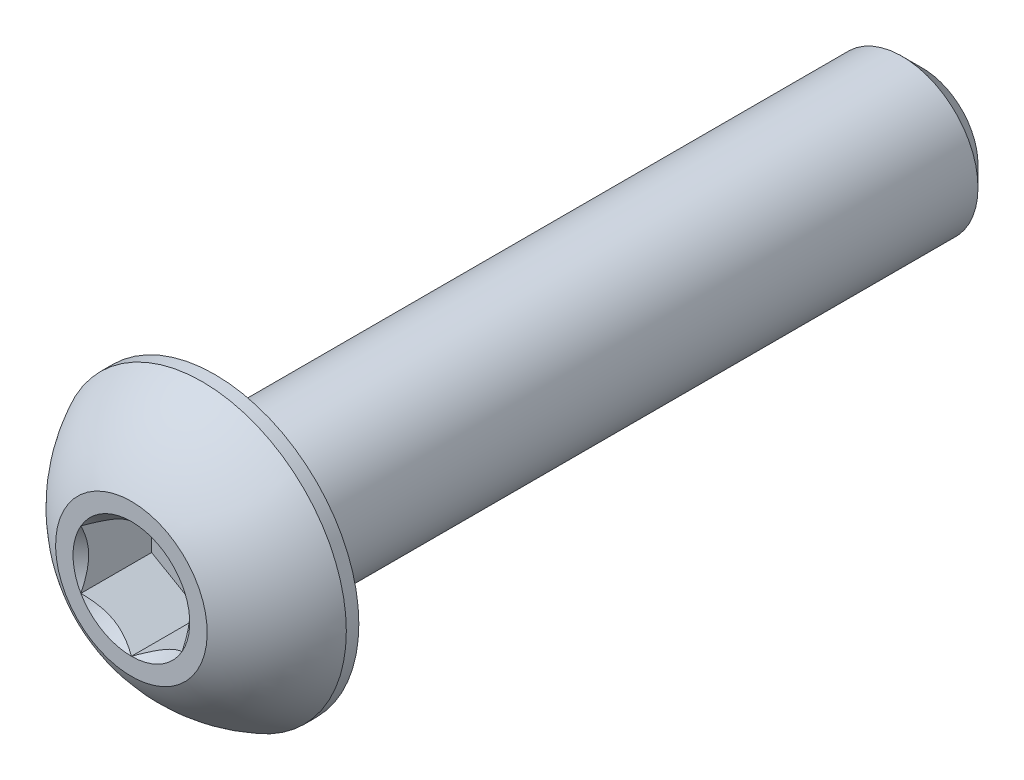
ISO-10303-21;
HEADER;
FILE_DESCRIPTION(('STEP AP214'),'2;1');
FILE_NAME('part.step','',(''),(''),'','','');
FILE_SCHEMA(('AUTOMOTIVE_DESIGN { 1 0 10303 214 1 1 1 1 }'));
ENDSEC;
DATA;
#1=APPLICATION_CONTEXT('core data for automotive mechanical design processes');
#2=APPLICATION_PROTOCOL_DEFINITION('international standard','automotive_design',2000,#1);
#3=PRODUCT_CONTEXT('',#1,'mechanical');
#4=PRODUCT('Part','Part','',(#3));
#5=PRODUCT_RELATED_PRODUCT_CATEGORY('part','',(#4));
#6=PRODUCT_DEFINITION_FORMATION('','',#4);
#7=PRODUCT_DEFINITION_CONTEXT('part definition',#1,'design');
#8=PRODUCT_DEFINITION('design','',#6,#7);
#9=PRODUCT_DEFINITION_SHAPE('','',#8);
#10=(LENGTH_UNIT() NAMED_UNIT(*) SI_UNIT(.MILLI.,.METRE.));
#11=(NAMED_UNIT(*) PLANE_ANGLE_UNIT() SI_UNIT($,.RADIAN.));
#12=(NAMED_UNIT(*) SI_UNIT($,.STERADIAN.) SOLID_ANGLE_UNIT());
#13=UNCERTAINTY_MEASURE_WITH_UNIT(LENGTH_MEASURE(1.E-05),#10,'distance_accuracy_value','');
#14=(GEOMETRIC_REPRESENTATION_CONTEXT(3) GLOBAL_UNCERTAINTY_ASSIGNED_CONTEXT((#13)) GLOBAL_UNIT_ASSIGNED_CONTEXT((#10,
#11,#12)) REPRESENTATION_CONTEXT('',''));
#15=CARTESIAN_POINT('',(0.,0.,0.));
#16=DIRECTION('',(0.,0.,1.));
#17=DIRECTION('',(1.,0.,0.));
#18=AXIS2_PLACEMENT_3D('',#15,#16,#17);
#19=CARTESIAN_POINT('',(0.,0.,7.825));
#20=DIRECTION('',(0.,0.,-1.));
#21=DIRECTION('',(-1.,0.,0.));
#22=AXIS2_PLACEMENT_3D('',#19,#20,#21);
#23=PLANE('',#22);
#24=CARTESIAN_POINT('',(0.,0.,7.825));
#25=DIRECTION('',(0.,0.,1.));
#26=DIRECTION('',(1.,0.,0.));
#27=AXIS2_PLACEMENT_3D('',#24,#25,#26);
#28=CIRCLE('',#27,1.15470053837925);
#29=CARTESIAN_POINT('',(-1.,0.577350269189626,7.825));
#30=VERTEX_POINT('',#29);
#31=CARTESIAN_POINT('',(-1.,-0.577350269189626,7.825));
#32=VERTEX_POINT('',#31);
#33=EDGE_CURVE('E130',#30,#32,#28,.T.);
#34=ORIENTED_EDGE('',*,*,#33,.F.);
#35=CARTESIAN_POINT('',(0.,1.15470053837925,7.825));
#36=VERTEX_POINT('',#35);
#37=EDGE_CURVE('E102',#36,#30,#28,.T.);
#38=ORIENTED_EDGE('',*,*,#37,.F.);
#39=CARTESIAN_POINT('',(1.,0.577350269189626,7.825));
#40=VERTEX_POINT('',#39);
#41=EDGE_CURVE('E93',#40,#36,#28,.T.);
#42=ORIENTED_EDGE('',*,*,#41,.F.);
#43=CARTESIAN_POINT('',(1.,-0.577350269189626,7.825));
#44=VERTEX_POINT('',#43);
#45=EDGE_CURVE('E54',#44,#40,#28,.T.);
#46=ORIENTED_EDGE('',*,*,#45,.F.);
#47=CARTESIAN_POINT('',(0.,-1.15470053837925,7.825));
#48=VERTEX_POINT('',#47);
#49=EDGE_CURVE('E61',#48,#44,#28,.T.);
#50=ORIENTED_EDGE('',*,*,#49,.F.);
#51=EDGE_CURVE('E131',#32,#48,#28,.T.);
#52=ORIENTED_EDGE('',*,*,#51,.F.);
#53=EDGE_LOOP('',(#34,#38,#42,#46,#50,#52));
#54=FACE_BOUND('',#53,.T.);
#55=CARTESIAN_POINT('',(0.,0.,7.825));
#56=DIRECTION('',(0.,0.,1.));
#57=DIRECTION('',(1.,0.,0.));
#58=AXIS2_PLACEMENT_3D('',#55,#56,#57);
#59=CIRCLE('',#58,1.5);
#60=CARTESIAN_POINT('',(0.,1.5,7.825));
#61=VERTEX_POINT('',#60);
#62=EDGE_CURVE('E48',#61,#61,#59,.T.);
#63=ORIENTED_EDGE('',*,*,#62,.T.);
#64=EDGE_LOOP('',(#63));
#65=FACE_BOUND('',#64,.T.);
#66=ADVANCED_FACE('F35',(#54,#65),#23,.F.);
#67=CARTESIAN_POINT('',(0.,0.,5.03016711229946));
#68=DIRECTION('',(0.,0.,1.));
#69=DIRECTION('',(0.,1.,0.));
#70=AXIS2_PLACEMENT_3D('',#67,#68,#69);
#71=SPHERICAL_SURFACE('',#70,3.17192226735973);
#72=CARTESIAN_POINT('',(0.,0.,6.4225));
#73=DIRECTION('',(0.,0.,1.));
#74=DIRECTION('',(1.,0.,0.));
#75=AXIS2_PLACEMENT_3D('',#72,#73,#74);
#76=CIRCLE('',#75,2.85);
#77=CARTESIAN_POINT('',(0.,2.85,6.4225));
#78=VERTEX_POINT('',#77);
#79=EDGE_CURVE('E213',#78,#78,#76,.T.);
#80=CARTESIAN_POINT('',(0.,1.5,7.825));
#81=CARTESIAN_POINT('',(0.,1.5181600798921,7.81525343052663));
#82=CARTESIAN_POINT('',(0.,1.53622513742981,7.80532981527615));
#83=CARTESIAN_POINT('',(0.,1.57215840256594,7.78513236887069));
#84=CARTESIAN_POINT('',(0.,1.59002661016438,7.7748585377157));
#85=CARTESIAN_POINT('',(0.,1.6255593701915,7.75396453515097));
#86=CARTESIAN_POINT('',(0.,1.64322392262019,7.74334436374123));
#87=CARTESIAN_POINT('',(0.,1.67834266450262,7.72176172357303));
#88=CARTESIAN_POINT('',(0.,1.69579685395635,7.71079925481458));
#89=CARTESIAN_POINT('',(0.,1.73048823664554,7.68853618336439));
#90=CARTESIAN_POINT('',(0.,1.74772542988099,7.67723558067265));
#91=CARTESIAN_POINT('',(0.,1.78197627078176,7.65430053581285));
#92=CARTESIAN_POINT('',(0.,1.79898991844709,7.64266609364478));
#93=CARTESIAN_POINT('',(0.,1.83278720341135,7.61906779045309));
#94=CARTESIAN_POINT('',(0.,1.84957084071028,7.60710392942946));
#95=CARTESIAN_POINT('',(0.,1.88290172764636,7.58285133450124));
#96=CARTESIAN_POINT('',(0.,1.8994489772835,7.57056260059666));
#97=CARTESIAN_POINT('',(0.,1.93230080139369,7.54566492927457));
#98=CARTESIAN_POINT('',(0.,1.94860537586673,7.53305599185708));
#99=CARTESIAN_POINT('',(0.,1.98096565436365,7.50752270455889));
#100=CARTESIAN_POINT('',(0.,1.99702135838753,7.49459835467819));
#101=CARTESIAN_POINT('',(0.,2.02887779526296,7.46843915334777));
#102=CARTESIAN_POINT('',(0.,2.04467852811452,7.45520430189805));
#103=CARTESIAN_POINT('',(0.,2.07601901880464,7.42842912630669));
#104=CARTESIAN_POINT('',(0.,2.09155877664321,7.41488880216506));
#105=CARTESIAN_POINT('',(0.,2.12237141262985,7.38750782613789));
#106=CARTESIAN_POINT('',(0.,2.13764429077792,7.37366717425237));
#107=CARTESIAN_POINT('',(0.,2.16791736411296,7.34569080180173));
#108=CARTESIAN_POINT('',(0.,2.18291755929993,7.33155508123663));
#109=CARTESIAN_POINT('',(0.,2.21263956705415,7.30299394260905));
#110=CARTESIAN_POINT('',(0.,2.22736137962139,7.28856852454658));
#111=CARTESIAN_POINT('',(0.,2.2565210282552,7.25943347218353));
#112=CARTESIAN_POINT('',(0.,2.27095886432177,7.24472383788294));
#113=CARTESIAN_POINT('',(0.,2.2995450739765,7.21502594229721));
#114=CARTESIAN_POINT('',(0.,2.31369344756465,7.20003768101205));
#115=CARTESIAN_POINT('',(0.,2.34169535627252,7.16978822658124));
#116=CARTESIAN_POINT('',(0.,2.35554889139223,7.15452703343559));
#117=CARTESIAN_POINT('',(0.,2.38295585920366,7.12373751411442));
#118=CARTESIAN_POINT('',(0.,2.39650929189537,7.1082091879389));
#119=CARTESIAN_POINT('',(0.,2.42331090492182,7.07689130289176));
#120=CARTESIAN_POINT('',(0.,2.43655908525656,7.06110174402014));
#121=CARTESIAN_POINT('',(0.,2.46274515962755,7.02926739317577));
#122=CARTESIAN_POINT('',(0.,2.47568305366379,7.01322260120302));
#123=CARTESIAN_POINT('',(0.,2.5012436393965,6.98088388073287));
#124=CARTESIAN_POINT('',(0.,2.51386633109298,6.96458995223548));
#125=CARTESIAN_POINT('',(0.,2.53879171587278,6.9317591499574));
#126=CARTESIAN_POINT('',(0.,2.55109440895612,6.91522227617671));
#127=CARTESIAN_POINT('',(0.,2.57537512182785,6.88191186688636));
#128=CARTESIAN_POINT('',(0.,2.58735314161625,6.8651383313767));
#129=CARTESIAN_POINT('',(0.,2.61097995657956,6.83136097210576));
#130=CARTESIAN_POINT('',(0.,2.62262875175448,6.81435714834448));
#131=CARTESIAN_POINT('',(0.,2.64559269128198,6.78012567355775));
#132=CARTESIAN_POINT('',(0.,2.65690783563457,6.76289802253229));
#133=CARTESIAN_POINT('',(0.,2.67920017403639,6.72822543922701));
#134=CARTESIAN_POINT('',(0.,2.69017736808561,6.71078050694718));
#135=CARTESIAN_POINT('',(0.,2.711789634999,6.67567998980005));
#136=CARTESIAN_POINT('',(0.,2.72242470786316,6.65802440493275));
#137=CARTESIAN_POINT('',(0.,2.74334869082117,6.62250929096058));
#138=CARTESIAN_POINT('',(0.,2.75363760091502,6.60464976185571));
#139=CARTESIAN_POINT('',(0.,2.77386535089241,6.56873354659176));
#140=CARTESIAN_POINT('',(0.,2.78380419077596,6.55067686043268));
#141=CARTESIAN_POINT('',(0.,2.80332801615778,6.51437318815589));
#142=CARTESIAN_POINT('',(0.,2.81291300165605,6.49612620203819));
#143=CARTESIAN_POINT('',(0.,2.83172550494215,6.45944887791611));
#144=CARTESIAN_POINT('',(0.,2.84095302272998,6.44101853991173));
#145=CARTESIAN_POINT('',(0.,2.85,6.4225));
#146=B_SPLINE_CURVE_WITH_KNOTS('',3,(#80,#81,#82,#83,#84,#85,#86,#87,#88,#89,#90,#91,#92,#93,
#94,#95,#96,#97,#98,#99,#100,#101,#102,#103,#104,#105,#106,#107,#108,#109,#110,#111,#112,#113,
#114,#115,#116,#117,#118,#119,#120,#121,#122,#123,#124,#125,#126,#127,#128,#129,#130,#131,#132,
#133,#134,#135,#136,#137,#138,#139,#140,#141,#142,#143,#144,#145),.UNSPECIFIED.,.F.,.F.,(4,2,2,
2,2,2,2,2,2,2,2,2,2,2,2,2,2,2,2,2,2,2,2,2,2,2,2,2,2,2,2,2,4),(0.,0.0618298941826988,
0.123659788365397,0.185489682548095,0.247319576730793,0.309149470913491,0.37097936509619,
0.432809259278887,0.494639153461586,0.556469047644283,0.618298941826982,0.68012883600968,
0.741958730192378,0.803788624375077,0.865618518557774,0.927448412740473,0.989278306923171,
1.05110820110587,1.11293809528857,1.17476798947127,1.23659788365396,1.29842777783666,
1.36025767201936,1.42208756620206,1.48391746038476,1.54574735456745,1.60757724875015,
1.66940714293285,1.73123703711555,1.79306693129825,1.85489682548094,1.91672671966364,
1.97855661384634),.UNSPECIFIED.);
#147=EDGE_CURVE('BSEAM218',#61,#78,#146,.T.);
#148=ORIENTED_EDGE('',*,*,#62,.F.);
#149=ORIENTED_EDGE('',*,*,#79,.T.);
#150=ORIENTED_EDGE('',*,*,#147,.T.);
#151=ORIENTED_EDGE('',*,*,#147,.F.);
#152=EDGE_LOOP('',(#148,#150,#149,#151));
#153=FACE_BOUND('',#152,.T.);
#154=ADVANCED_FACE('F218',(#153),#71,.T.);
#155=CARTESIAN_POINT('',(0.,0.,7.825));
#156=DIRECTION('',(0.,0.,1.));
#157=DIRECTION('',(1.,0.,0.));
#158=AXIS2_PLACEMENT_3D('',#155,#156,#157);
#159=CYLINDRICAL_SURFACE('',#158,2.85);
#160=ORIENTED_EDGE('',*,*,#79,.F.);
#161=EDGE_LOOP('',(#160));
#162=FACE_BOUND('',#161,.T.);
#163=CARTESIAN_POINT('',(0.,0.,6.175));
#164=DIRECTION('',(0.,0.,1.));
#165=DIRECTION('',(1.,0.,0.));
#166=AXIS2_PLACEMENT_3D('',#163,#164,#165);
#167=CIRCLE('',#166,2.85);
#168=CARTESIAN_POINT('',(2.85,0.,6.175));
#169=VERTEX_POINT('',#168);
#170=EDGE_CURVE('E210',#169,#169,#167,.T.);
#171=ORIENTED_EDGE('',*,*,#170,.T.);
#172=EDGE_LOOP('',(#171));
#173=FACE_BOUND('',#172,.T.);
#174=ADVANCED_FACE('F221',(#162,#173),#159,.T.);
#175=CARTESIAN_POINT('',(0.,1.5,6.175));
#176=DIRECTION('',(0.,0.,1.));
#177=DIRECTION('',(1.,0.,0.));
#178=AXIS2_PLACEMENT_3D('',#175,#176,#177);
#179=PLANE('',#178);
#180=ORIENTED_EDGE('',*,*,#170,.F.);
#181=EDGE_LOOP('',(#180));
#182=FACE_BOUND('',#181,.T.);
#183=CARTESIAN_POINT('',(0.,0.,6.175));
#184=DIRECTION('',(0.,0.,1.));
#185=DIRECTION('',(1.,0.,0.));
#186=AXIS2_PLACEMENT_3D('',#183,#184,#185);
#187=CIRCLE('',#186,1.5);
#188=CARTESIAN_POINT('',(1.5,0.,6.175));
#189=VERTEX_POINT('',#188);
#190=EDGE_CURVE('E207',#189,#189,#187,.T.);
#191=ORIENTED_EDGE('',*,*,#190,.T.);
#192=EDGE_LOOP('',(#191));
#193=FACE_BOUND('',#192,.T.);
#194=ADVANCED_FACE('F226',(#182,#193),#179,.F.);
#195=CARTESIAN_POINT('',(0.,0.,7.825));
#196=DIRECTION('',(0.,0.,1.));
#197=DIRECTION('',(1.,0.,0.));
#198=AXIS2_PLACEMENT_3D('',#195,#196,#197);
#199=CYLINDRICAL_SURFACE('',#198,1.5);
#200=ORIENTED_EDGE('',*,*,#190,.F.);
#201=EDGE_LOOP('',(#200));
#202=FACE_BOUND('',#201,.T.);
#203=CARTESIAN_POINT('',(0.,0.,-7.425));
#204=DIRECTION('',(0.,0.,1.));
#205=DIRECTION('',(1.,0.,0.));
#206=AXIS2_PLACEMENT_3D('',#203,#204,#205);
#207=CIRCLE('',#206,1.5);
#208=CARTESIAN_POINT('',(1.5,0.,-7.425));
#209=VERTEX_POINT('',#208);
#210=EDGE_CURVE('E204',#209,#209,#207,.T.);
#211=ORIENTED_EDGE('',*,*,#210,.T.);
#212=EDGE_LOOP('',(#211));
#213=FACE_BOUND('',#212,.T.);
#214=ADVANCED_FACE('F232',(#202,#213),#199,.T.);
#215=CARTESIAN_POINT('',(0.,0.,-7.825));
#216=DIRECTION('',(0.,0.,1.));
#217=DIRECTION('',(1.,0.,0.));
#218=AXIS2_PLACEMENT_3D('',#215,#216,#217);
#219=CONICAL_SURFACE('',#218,1.1,0.785398163397444);
#220=ORIENTED_EDGE('',*,*,#210,.F.);
#221=EDGE_LOOP('',(#220));
#222=FACE_BOUND('',#221,.T.);
#223=CARTESIAN_POINT('',(0.,0.,-7.825));
#224=DIRECTION('',(0.,0.,1.));
#225=DIRECTION('',(1.,0.,0.));
#226=AXIS2_PLACEMENT_3D('',#223,#224,#225);
#227=CIRCLE('',#226,1.1);
#228=CARTESIAN_POINT('',(1.1,0.,-7.825));
#229=VERTEX_POINT('',#228);
#230=EDGE_CURVE('E191',#229,#229,#227,.T.);
#231=ORIENTED_EDGE('',*,*,#230,.T.);
#232=EDGE_LOOP('',(#231));
#233=FACE_BOUND('',#232,.T.);
#234=ADVANCED_FACE('F238',(#222,#233),#219,.T.);
#235=CARTESIAN_POINT('',(0.,0.,-7.825));
#236=DIRECTION('',(0.,0.,1.));
#237=DIRECTION('',(1.,0.,0.));
#238=AXIS2_PLACEMENT_3D('',#235,#236,#237);
#239=PLANE('',#238);
#240=ORIENTED_EDGE('',*,*,#230,.F.);
#241=EDGE_LOOP('',(#240));
#242=FACE_BOUND('',#241,.T.);
#243=ADVANCED_FACE('F164',(#242),#239,.F.);
#244=CARTESIAN_POINT('',(0.,0.,7.825));
#245=DIRECTION('',(0.,0.,1.));
#246=DIRECTION('',(1.,0.,0.));
#247=AXIS2_PLACEMENT_3D('',#244,#245,#246);
#248=CONICAL_SURFACE('',#247,1.15470053837925,0.78539816339745);
#249=ORIENTED_EDGE('',*,*,#37,.T.);
#250=CARTESIAN_POINT('',(0.000200000000000198,1.15481600843309,7.82511548737261));
#251=CARTESIAN_POINT('',(-0.0341825950071805,1.13496520795026,7.80527793082573));
#252=CARTESIAN_POINT('',(-0.0691401181398248,1.11478247255942,7.78660502063889));
#253=CARTESIAN_POINT('',(-0.14042280295609,1.07362739529219,7.75241474272316));
#254=CARTESIAN_POINT('',(-0.176754750528984,1.0526511355808,7.73691640902346));
#255=CARTESIAN_POINT('',(-0.250016613803311,1.01035337909803,7.71036730714226));
#256=CARTESIAN_POINT('',(-0.286927851445414,0.989042666109241,7.69924977399692));
#257=CARTESIAN_POINT('',(-0.361562729310859,0.945952199282692,7.68211986577618));
#258=CARTESIAN_POINT('',(-0.399284088108636,0.924173762626597,7.67609469746667));
#259=CARTESIAN_POINT('',(-0.464292198417934,0.886641312640015,7.67066055496749));
#260=CARTESIAN_POINT('',(-0.491494371528172,0.870936130672276,7.66985693831673));
#261=CARTESIAN_POINT('',(-0.545846040669112,0.839556179862849,7.67120669941689));
#262=CARTESIAN_POINT('',(-0.572995523754876,0.823881418494924,7.6733607295472));
#263=CARTESIAN_POINT('',(-0.65405627732696,0.777080970599367,7.68411697212847));
#264=CARTESIAN_POINT('',(-0.707564140978428,0.746188191116431,7.69701455641535));
#265=CARTESIAN_POINT('',(-0.801476065143432,0.69196811641965,7.72814073060218));
#266=CARTESIAN_POINT('',(-0.842320523671834,0.668386557293372,7.74473779770184));
#267=CARTESIAN_POINT('',(-0.922409637381944,0.622147085933682,7.78212492468529));
#268=CARTESIAN_POINT('',(-0.961659010870438,0.599486449584576,7.8029013418174));
#269=CARTESIAN_POINT('',(-1.0002,0.577234799135788,7.82511548737261));
#270=B_SPLINE_CURVE_WITH_KNOTS('',3,(#250,#251,#252,#253,#254,#255,#256,#257,#258,#259,#260,
#261,#262,#263,#264,#265,#266,#267,#268,#269),.UNSPECIFIED.,.F.,.F.,(4,2,2,2,2,2,2,2,2,4),(0.,
0.133237676828559,0.267252229834491,0.399137076269301,0.530689603280769,0.624814864263847,
0.718960890149133,0.907306626112098,1.05710100361789,1.20641411519286),.UNSPECIFIED.);
#271=EDGE_CURVE('E11',#36,#30,#270,.T.);
#272=ORIENTED_EDGE('',*,*,#271,.F.);
#273=EDGE_LOOP('',(#249,#272));
#274=FACE_BOUND('',#273,.T.);
#275=ADVANCED_FACE('F106',(#274),#248,.F.);
#276=ORIENTED_EDGE('',*,*,#33,.T.);
#277=CARTESIAN_POINT('',(-1.,-1.15147208646462,8.19538567751386));
#278=CARTESIAN_POINT('',(-1.,-1.12343447988552,8.17421991987371));
#279=CARTESIAN_POINT('',(-1.,-1.09524064850697,8.15326169217591));
#280=CARTESIAN_POINT('',(-1.,-1.03847715644376,8.11184602223562));
#281=CARTESIAN_POINT('',(-1.,-1.00990740382975,8.09138870612366));
#282=CARTESIAN_POINT('',(-1.,-0.923120894333476,8.03060479495451));
#283=CARTESIAN_POINT('',(-1.,-0.864253173759059,7.99119222896139));
#284=CARTESIAN_POINT('',(-1.,-0.740809858258044,7.9138206642002));
#285=CARTESIAN_POINT('',(-1.,-0.676100255137806,7.87607303911434));
#286=CARTESIAN_POINT('',(-1.,-0.543448939049123,7.80702458755129));
#287=CARTESIAN_POINT('',(-1.,-0.475519112027778,7.77570202784686));
#288=CARTESIAN_POINT('',(-1.,-0.373555850333528,7.73738177888379));
#289=CARTESIAN_POINT('',(-1.,-0.341031989670907,7.72638359164215));
#290=CARTESIAN_POINT('',(-1.,-0.275199079052293,7.70699834214736));
#291=CARTESIAN_POINT('',(-1.,-0.241889975173932,7.6986114597767));
#292=CARTESIAN_POINT('',(-1.,-0.175247517042992,7.68502522071902));
#293=CARTESIAN_POINT('',(-1.,-0.141925568218174,7.67977079076796));
#294=CARTESIAN_POINT('',(-1.,-0.0749144362322786,7.67254868657089));
#295=CARTESIAN_POINT('',(-1.,-0.0412251978501613,7.67058151361051));
#296=CARTESIAN_POINT('',(-1.,0.0249580992634213,7.67008319839316));
#297=CARTESIAN_POINT('',(-1.,0.0574512826460395,7.67143026788863));
#298=CARTESIAN_POINT('',(-1.,0.122148505701867,7.67721648449898));
#299=CARTESIAN_POINT('',(-1.,0.154352610132926,7.68165492066153));
#300=CARTESIAN_POINT('',(-1.,0.21879989886764,7.6934568301452));
#301=CARTESIAN_POINT('',(-1.,0.251033743268954,7.70087054103851));
#302=CARTESIAN_POINT('',(-1.,0.314797132354919,7.71822894249867));
#303=CARTESIAN_POINT('',(-1.,0.346326735731005,7.72817342128883));
#304=CARTESIAN_POINT('',(-1.,0.445594187730205,7.76322348255434));
#305=CARTESIAN_POINT('',(-1.,0.511919139476036,7.79232085835672));
#306=CARTESIAN_POINT('',(-1.,0.641453244657532,7.8570153296865));
#307=CARTESIAN_POINT('',(-1.,0.704650133126345,7.89263577671524));
#308=CARTESIAN_POINT('',(-1.,0.825428490174987,7.96612390134693));
#309=CARTESIAN_POINT('',(-1.,0.883132947867685,8.00379194713546));
#310=CARTESIAN_POINT('',(-1.,0.968148853704565,8.06202285294316));
#311=CARTESIAN_POINT('',(-1.,0.996120570380284,8.08163847576285));
#312=CARTESIAN_POINT('',(-1.,1.05168177729901,8.12138851706127));
#313=CARTESIAN_POINT('',(-1.,1.079271369977,8.14152279219883));
#314=CARTESIAN_POINT('',(-1.,1.10670185346329,8.16187211907297));
#315=B_SPLINE_CURVE_WITH_KNOTS('',3,(#277,#278,#279,#280,#281,#282,#283,#284,#285,#286,#287,
#288,#289,#290,#291,#292,#293,#294,#295,#296,#297,#298,#299,#300,#301,#302,#303,#304,#305,#306,
#307,#308,#309,#310,#311,#312,#313,#314),.UNSPECIFIED.,.F.,.F.,(4,2,2,2,2,2,2,2,2,2,2,2,2,2,2,2,
2,2,4),(0.,0.10538645908329,0.210799187330124,0.423233611565469,0.647793540908503,
0.871580877738609,0.97449307418142,1.07741235827201,1.17846428203205,1.27953161415762,
1.3769408673961,1.47432772585408,1.57343322804293,1.67253043972851,1.88917353996827,
2.10660791038813,2.31323734249843,2.41572589232044,2.51818641476503),.UNSPECIFIED.);
#316=EDGE_CURVE('E101',#30,#32,#315,.F.);
#317=ORIENTED_EDGE('',*,*,#316,.F.);
#318=EDGE_LOOP('',(#276,#317));
#319=FACE_BOUND('',#318,.T.);
#320=ADVANCED_FACE('F251',(#319),#248,.F.);
#321=ORIENTED_EDGE('',*,*,#51,.T.);
#322=CARTESIAN_POINT('',(-1.0002,-0.577234799135788,7.82511548737261));
#323=CARTESIAN_POINT('',(-0.965817404992819,-0.597085599618621,7.80527793082573));
#324=CARTESIAN_POINT('',(-0.930859881860175,-0.617268335009456,7.78660502063889));
#325=CARTESIAN_POINT('',(-0.85957719704391,-0.658423412276686,7.75241474272316));
#326=CARTESIAN_POINT('',(-0.823245249471016,-0.67939967198808,7.73691640902346));
#327=CARTESIAN_POINT('',(-0.749983386196689,-0.721697428470846,7.71036730714226));
#328=CARTESIAN_POINT('',(-0.713072148554586,-0.743008141459636,7.69924977399692));
#329=CARTESIAN_POINT('',(-0.638437270689141,-0.786098608286185,7.68211986577618));
#330=CARTESIAN_POINT('',(-0.600715911891365,-0.80787704494228,7.67609469746667));
#331=CARTESIAN_POINT('',(-0.535707801582068,-0.845409494928862,7.67066055496749));
#332=CARTESIAN_POINT('',(-0.508505628471829,-0.861114676896601,7.66985693831673));
#333=CARTESIAN_POINT('',(-0.454153959330889,-0.892494627706028,7.67120669941689));
#334=CARTESIAN_POINT('',(-0.427004476245126,-0.908169389073953,7.6733607295472));
#335=CARTESIAN_POINT('',(-0.345943722673041,-0.95496983696951,7.68411697212847));
#336=CARTESIAN_POINT('',(-0.292435859021574,-0.985862616452446,7.69701455641535));
#337=CARTESIAN_POINT('',(-0.19852393485657,-1.04008269114923,7.72814073060218));
#338=CARTESIAN_POINT('',(-0.157679476328167,-1.06366425027551,7.74473779770184));
#339=CARTESIAN_POINT('',(-0.077590362618057,-1.1099037216352,7.78212492468529));
#340=CARTESIAN_POINT('',(-0.0383409891295629,-1.1325643579843,7.8029013418174));
#341=CARTESIAN_POINT('',(0.000199999999999282,-1.15481600843309,7.82511548737261));
#342=B_SPLINE_CURVE_WITH_KNOTS('',3,(#322,#323,#324,#325,#326,#327,#328,#329,#330,#331,#332,
#333,#334,#335,#336,#337,#338,#339,#340,#341),.UNSPECIFIED.,.F.,.F.,(4,2,2,2,2,2,2,2,2,4),(0.,
0.133237676828559,0.26725222983449,0.399137076269299,0.530689603280766,0.624814864263844,
0.718960890149131,0.907306626112095,1.05710100361789,1.20641411519286),.UNSPECIFIED.);
#343=EDGE_CURVE('E140',#32,#48,#342,.T.);
#344=ORIENTED_EDGE('',*,*,#343,.F.);
#345=EDGE_LOOP('',(#321,#344));
#346=FACE_BOUND('',#345,.T.);
#347=ADVANCED_FACE('F268',(#346),#248,.F.);
#348=ORIENTED_EDGE('',*,*,#49,.T.);
#349=CARTESIAN_POINT('',(-0.000199999999999995,-1.15481600843309,7.82511548737261));
#350=CARTESIAN_POINT('',(0.0341825950071809,-1.13496520795026,7.80527793082573));
#351=CARTESIAN_POINT('',(0.0691401181398251,-1.11478247255942,7.78660502063889));
#352=CARTESIAN_POINT('',(0.14042280295609,-1.07362739529219,7.75241474272316));
#353=CARTESIAN_POINT('',(0.176754750528984,-1.0526511355808,7.73691640902346));
#354=CARTESIAN_POINT('',(0.250016613803311,-1.01035337909803,7.71036730714226));
#355=CARTESIAN_POINT('',(0.286927851445414,-0.98904266610924,7.69924977399692));
#356=CARTESIAN_POINT('',(0.361562729310859,-0.945952199282691,7.68211986577618));
#357=CARTESIAN_POINT('',(0.399284088108636,-0.924173762626596,7.67609469746667));
#358=CARTESIAN_POINT('',(0.464292198417934,-0.886641312640014,7.67066055496749));
#359=CARTESIAN_POINT('',(0.491494371528172,-0.870936130672275,7.66985693831673));
#360=CARTESIAN_POINT('',(0.545846040669112,-0.839556179862848,7.67120669941689));
#361=CARTESIAN_POINT('',(0.572995523754876,-0.823881418494923,7.6733607295472));
#362=CARTESIAN_POINT('',(0.65405627732696,-0.777080970599366,7.68411697212847));
#363=CARTESIAN_POINT('',(0.707564140978428,-0.74618819111643,7.69701455641535));
#364=CARTESIAN_POINT('',(0.801476065143432,-0.691968116419649,7.72814073060218));
#365=CARTESIAN_POINT('',(0.842320523671834,-0.668386557293371,7.74473779770184));
#366=CARTESIAN_POINT('',(0.922409637381943,-0.622147085933681,7.78212492468529));
#367=CARTESIAN_POINT('',(0.961659010870437,-0.599486449584575,7.8029013418174));
#368=CARTESIAN_POINT('',(1.0002,-0.577234799135788,7.82511548737261));
#369=B_SPLINE_CURVE_WITH_KNOTS('',3,(#349,#350,#351,#352,#353,#354,#355,#356,#357,#358,#359,
#360,#361,#362,#363,#364,#365,#366,#367,#368),.UNSPECIFIED.,.F.,.F.,(4,2,2,2,2,2,2,2,2,4),(0.,
0.133237676828559,0.26725222983449,0.3991370762693,0.530689603280768,0.624814864263846,
0.718960890149133,0.907306626112097,1.05710100361789,1.20641411519286),.UNSPECIFIED.);
#370=EDGE_CURVE('E348',#48,#44,#369,.T.);
#371=ORIENTED_EDGE('',*,*,#370,.F.);
#372=EDGE_LOOP('',(#348,#371));
#373=FACE_BOUND('',#372,.T.);
#374=ADVANCED_FACE('F275',(#373),#248,.F.);
#375=ORIENTED_EDGE('',*,*,#45,.T.);
#376=CARTESIAN_POINT('',(1.,-1.15147208663215,8.19538567764035));
#377=CARTESIAN_POINT('',(1.,-1.12343448004835,8.17421991999533));
#378=CARTESIAN_POINT('',(1.,-1.09524064866509,8.15326169229266));
#379=CARTESIAN_POINT('',(1.,-1.0384771565924,8.11184602234267));
#380=CARTESIAN_POINT('',(1.,-1.00990740397362,8.09138870622587));
#381=CARTESIAN_POINT('',(1.,-0.923120894462774,8.03060479504212));
#382=CARTESIAN_POINT('',(1.,-0.864253173878444,7.99119222903932));
#383=CARTESIAN_POINT('',(1.,-0.74080985835581,7.91382066425819));
#384=CARTESIAN_POINT('',(1.,-0.676100255223807,7.87607303916216));
#385=CARTESIAN_POINT('',(1.,-0.543448939110597,7.80702458758025));
#386=CARTESIAN_POINT('',(1.,-0.475519112076495,7.77570202786713));
#387=CARTESIAN_POINT('',(1.,-0.373555850372648,7.7373817788976));
#388=CARTESIAN_POINT('',(1.,-0.341031989714046,7.72638359165621));
#389=CARTESIAN_POINT('',(1.,-0.275199079103601,7.70699834216111));
#390=CARTESIAN_POINT('',(1.,-0.241889975229392,7.69861145978989));
#391=CARTESIAN_POINT('',(1.,-0.175247517106615,7.68502522073014));
#392=CARTESIAN_POINT('',(1.,-0.141925568285808,7.67977079077761));
#393=CARTESIAN_POINT('',(1.,-0.0749144363078013,7.67254868657667));
#394=CARTESIAN_POINT('',(1.,-0.041225197929563,7.6705815136139));
#395=CARTESIAN_POINT('',(1.,0.024958099176864,7.67008319839111));
#396=CARTESIAN_POINT('',(1.,0.0574512825561954,7.67143026788357));
#397=CARTESIAN_POINT('',(1.,0.122148505605778,7.67721648448742));
#398=CARTESIAN_POINT('',(1.,0.15435261003388,7.68165492064648));
#399=CARTESIAN_POINT('',(1.,0.218799898762754,7.69345683012285));
#400=CARTESIAN_POINT('',(1.,0.251033743161195,7.70087054101231));
#401=CARTESIAN_POINT('',(1.,0.314797132241693,7.71822894246471));
#402=CARTESIAN_POINT('',(1.,0.346326735615183,7.72817342125094));
#403=CARTESIAN_POINT('',(1.,0.445594187589164,7.76322348249794));
#404=CARTESIAN_POINT('',(1.,0.511919139313635,7.7923208582833));
#405=CARTESIAN_POINT('',(1.,0.641453244454048,7.85701532957715));
#406=CARTESIAN_POINT('',(1.,0.70465013290315,7.89263577658696));
#407=CARTESIAN_POINT('',(1.,0.825428489916355,7.96612390118245));
#408=CARTESIAN_POINT('',(1.,0.8831329475932,8.00379194695385));
#409=CARTESIAN_POINT('',(1.,0.968148853406641,8.06202285273595));
#410=CARTESIAN_POINT('',(1.,0.996120570074659,8.08163847554717));
#411=CARTESIAN_POINT('',(1.,1.05168177697804,8.12138851682867));
#412=CARTESIAN_POINT('',(1.,1.07927136964837,8.14152279195778));
#413=CARTESIAN_POINT('',(1.,1.10670185312703,8.16187211882347));
#414=B_SPLINE_CURVE_WITH_KNOTS('',3,(#376,#377,#378,#379,#380,#381,#382,#383,#384,#385,#386,
#387,#388,#389,#390,#391,#392,#393,#394,#395,#396,#397,#398,#399,#400,#401,#402,#403,#404,#405,
#406,#407,#408,#409,#410,#411,#412,#413),.UNSPECIFIED.,.F.,.F.,(4,2,2,2,2,2,2,2,2,2,2,2,2,2,2,2,
2,2,4),(0.,0.10538645910335,0.210799187370248,0.423233611646473,0.64779354103535,
0.871580877910864,0.974493074342053,1.07741235842104,1.17846428216995,1.27953161428439,
1.37694086751269,1.47432772596047,1.57343322813835,1.67253043981296,1.88917353997386,
2.10660791031433,2.31323734235672,2.41572589214523,2.51818641455632),.UNSPECIFIED.);
#415=EDGE_CURVE('E118',#44,#40,#414,.T.);
#416=ORIENTED_EDGE('',*,*,#415,.F.);
#417=EDGE_LOOP('',(#375,#416));
#418=FACE_BOUND('',#417,.T.);
#419=ADVANCED_FACE('F282',(#418),#248,.F.);
#420=ORIENTED_EDGE('',*,*,#41,.T.);
#421=CARTESIAN_POINT('',(1.0002,0.577234799135788,7.82511548737261));
#422=CARTESIAN_POINT('',(0.965817404992819,0.597085599618622,7.80527793082573));
#423=CARTESIAN_POINT('',(0.930859881860175,0.617268335009457,7.78660502063889));
#424=CARTESIAN_POINT('',(0.85957719704391,0.658423412276687,7.75241474272316));
#425=CARTESIAN_POINT('',(0.823245249471016,0.67939967198808,7.73691640902346));
#426=CARTESIAN_POINT('',(0.749983386196689,0.721697428470847,7.71036730714226));
#427=CARTESIAN_POINT('',(0.713072148554585,0.743008141459637,7.69924977399692));
#428=CARTESIAN_POINT('',(0.638437270689141,0.786098608286187,7.68211986577618));
#429=CARTESIAN_POINT('',(0.600715911891364,0.807877044942282,7.67609469746667));
#430=CARTESIAN_POINT('',(0.535707801582066,0.845409494928864,7.67066055496749));
#431=CARTESIAN_POINT('',(0.508505628471828,0.861114676896603,7.66985693831673));
#432=CARTESIAN_POINT('',(0.454153959330888,0.89249462770603,7.67120669941689));
#433=CARTESIAN_POINT('',(0.427004476245124,0.908169389073955,7.6733607295472));
#434=CARTESIAN_POINT('',(0.345943722673039,0.954969836969512,7.68411697212847));
#435=CARTESIAN_POINT('',(0.292435859021572,0.985862616452448,7.69701455641535));
#436=CARTESIAN_POINT('',(0.198523934856568,1.04008269114923,7.72814073060218));
#437=CARTESIAN_POINT('',(0.157679476328165,1.06366425027551,7.74473779770184));
#438=CARTESIAN_POINT('',(0.0775903626180561,1.1099037216352,7.78212492468529));
#439=CARTESIAN_POINT('',(0.0383409891295621,1.1325643579843,7.8029013418174));
#440=CARTESIAN_POINT('',(-0.000200000000000142,1.15481600843309,7.82511548737261));
#441=B_SPLINE_CURVE_WITH_KNOTS('',3,(#421,#422,#423,#424,#425,#426,#427,#428,#429,#430,#431,
#432,#433,#434,#435,#436,#437,#438,#439,#440),.UNSPECIFIED.,.F.,.F.,(4,2,2,2,2,2,2,2,2,4),(0.,
0.133237676828559,0.26725222983449,0.399137076269301,0.530689603280769,0.624814864263847,
0.718960890149134,0.907306626112098,1.05710100361789,1.20641411519286),.UNSPECIFIED.);
#442=EDGE_CURVE('E97',#40,#36,#441,.T.);
#443=ORIENTED_EDGE('',*,*,#442,.F.);
#444=EDGE_LOOP('',(#420,#443));
#445=FACE_BOUND('',#444,.T.);
#446=ADVANCED_FACE('F95',(#445),#248,.F.);
#447=CARTESIAN_POINT('',(0.,0.,6.425));
#448=DIRECTION('',(0.,0.,1.));
#449=DIRECTION('',(1.,0.,0.));
#450=AXIS2_PLACEMENT_3D('',#447,#448,#449);
#451=PLANE('',#450);
#452=DIRECTION('',(-0.866025403784439,0.5,0.));
#453=VECTOR('',#452,1.);
#454=CARTESIAN_POINT('',(1.,0.577350269189626,6.425));
#455=LINE('',#454,#453);
#456=CARTESIAN_POINT('',(1.,0.577350269189626,6.425));
#457=VERTEX_POINT('',#456);
#458=CARTESIAN_POINT('',(0.,1.15470053837925,6.425));
#459=VERTEX_POINT('',#458);
#460=EDGE_CURVE('E117',#457,#459,#455,.T.);
#461=ORIENTED_EDGE('',*,*,#460,.T.);
#462=DIRECTION('',(-0.866025403784439,-0.5,0.));
#463=VECTOR('',#462,1.);
#464=CARTESIAN_POINT('',(0.,1.15470053837925,6.425));
#465=LINE('',#464,#463);
#466=CARTESIAN_POINT('',(-1.,0.577350269189626,6.425));
#467=VERTEX_POINT('',#466);
#468=EDGE_CURVE('E122',#459,#467,#465,.T.);
#469=ORIENTED_EDGE('',*,*,#468,.T.);
#470=DIRECTION('',(0.,-1.,0.));
#471=VECTOR('',#470,1.);
#472=CARTESIAN_POINT('',(-1.,0.577350269189626,6.425));
#473=LINE('',#472,#471);
#474=CARTESIAN_POINT('',(-1.,-0.577350269189625,6.425));
#475=VERTEX_POINT('',#474);
#476=EDGE_CURVE('E179',#467,#475,#473,.T.);
#477=ORIENTED_EDGE('',*,*,#476,.T.);
#478=DIRECTION('',(0.866025403784438,-0.5,0.));
#479=VECTOR('',#478,1.);
#480=CARTESIAN_POINT('',(-1.,-0.577350269189625,6.425));
#481=LINE('',#480,#479);
#482=CARTESIAN_POINT('',(0.,-1.15470053837925,6.425));
#483=VERTEX_POINT('',#482);
#484=EDGE_CURVE('E182',#475,#483,#481,.T.);
#485=ORIENTED_EDGE('',*,*,#484,.T.);
#486=DIRECTION('',(0.866025403784439,0.5,0.));
#487=VECTOR('',#486,1.);
#488=CARTESIAN_POINT('',(0.,-1.15470053837925,6.425));
#489=LINE('',#488,#487);
#490=CARTESIAN_POINT('',(1.,-0.577350269189626,6.425));
#491=VERTEX_POINT('',#490);
#492=EDGE_CURVE('E185',#483,#491,#489,.T.);
#493=ORIENTED_EDGE('',*,*,#492,.T.);
#494=DIRECTION('',(0.,1.,0.));
#495=VECTOR('',#494,1.);
#496=CARTESIAN_POINT('',(1.,-0.577350269189626,6.425));
#497=LINE('',#496,#495);
#498=EDGE_CURVE('E125',#491,#457,#497,.T.);
#499=ORIENTED_EDGE('',*,*,#498,.T.);
#500=EDGE_LOOP('',(#461,#469,#477,#485,#493,#499));
#501=FACE_BOUND('',#500,.T.);
#502=ADVANCED_FACE('F159',(#501),#451,.T.);
#503=CARTESIAN_POINT('',(0.,1.15470053837925,6.425));
#504=DIRECTION('',(-0.5,0.866025403784439,0.));
#505=DIRECTION('',(-0.866025403784439,-0.5,0.));
#506=AXIS2_PLACEMENT_3D('',#503,#504,#505);
#507=PLANE('',#506);
#508=DIRECTION('',(0.,0.,1.));
#509=VECTOR('',#508,1.);
#510=CARTESIAN_POINT('',(0.,1.15470053837925,6.425));
#511=LINE('',#510,#509);
#512=EDGE_CURVE('E114',#459,#36,#511,.T.);
#513=ORIENTED_EDGE('',*,*,#512,.T.);
#514=ORIENTED_EDGE('',*,*,#271,.T.);
#515=DIRECTION('',(0.,0.,1.));
#516=VECTOR('',#515,1.);
#517=CARTESIAN_POINT('',(-1.,0.577350269189626,6.425));
#518=LINE('',#517,#516);
#519=EDGE_CURVE('E124',#467,#30,#518,.T.);
#520=ORIENTED_EDGE('',*,*,#519,.F.);
#521=ORIENTED_EDGE('',*,*,#468,.F.);
#522=EDGE_LOOP('',(#513,#514,#520,#521));
#523=FACE_BOUND('',#522,.T.);
#524=ADVANCED_FACE('F120',(#523),#507,.F.);
#525=CARTESIAN_POINT('',(-1.,0.577350269189626,6.425));
#526=DIRECTION('',(-1.,0.,0.));
#527=DIRECTION('',(0.,0.,1.));
#528=AXIS2_PLACEMENT_3D('',#525,#526,#527);
#529=PLANE('',#528);
#530=ORIENTED_EDGE('',*,*,#519,.T.);
#531=ORIENTED_EDGE('',*,*,#316,.T.);
#532=DIRECTION('',(0.,0.,1.));
#533=VECTOR('',#532,1.);
#534=CARTESIAN_POINT('',(-1.,-0.577350269189625,6.425));
#535=LINE('',#534,#533);
#536=EDGE_CURVE('E198',#475,#32,#535,.T.);
#537=ORIENTED_EDGE('',*,*,#536,.F.);
#538=ORIENTED_EDGE('',*,*,#476,.F.);
#539=EDGE_LOOP('',(#530,#531,#537,#538));
#540=FACE_BOUND('',#539,.T.);
#541=ADVANCED_FACE('F149',(#540),#529,.F.);
#542=CARTESIAN_POINT('',(-1.,-0.577350269189625,6.425));
#543=DIRECTION('',(-0.5,-0.866025403784438,0.));
#544=DIRECTION('',(0.866025403784439,-0.5,0.));
#545=AXIS2_PLACEMENT_3D('',#542,#543,#544);
#546=PLANE('',#545);
#547=ORIENTED_EDGE('',*,*,#536,.T.);
#548=ORIENTED_EDGE('',*,*,#343,.T.);
#549=DIRECTION('',(0.,0.,1.));
#550=VECTOR('',#549,1.);
#551=CARTESIAN_POINT('',(0.,-1.15470053837925,6.425));
#552=LINE('',#551,#550);
#553=EDGE_CURVE('E195',#483,#48,#552,.T.);
#554=ORIENTED_EDGE('',*,*,#553,.F.);
#555=ORIENTED_EDGE('',*,*,#484,.F.);
#556=EDGE_LOOP('',(#547,#548,#554,#555));
#557=FACE_BOUND('',#556,.T.);
#558=ADVANCED_FACE('F152',(#557),#546,.F.);
#559=CARTESIAN_POINT('',(0.,-1.15470053837925,6.425));
#560=DIRECTION('',(0.5,-0.866025403784439,0.));
#561=DIRECTION('',(0.866025403784439,0.5,0.));
#562=AXIS2_PLACEMENT_3D('',#559,#560,#561);
#563=PLANE('',#562);
#564=ORIENTED_EDGE('',*,*,#553,.T.);
#565=ORIENTED_EDGE('',*,*,#370,.T.);
#566=DIRECTION('',(0.,0.,1.));
#567=VECTOR('',#566,1.);
#568=CARTESIAN_POINT('',(1.,-0.577350269189626,6.425));
#569=LINE('',#568,#567);
#570=EDGE_CURVE('E192',#491,#44,#569,.T.);
#571=ORIENTED_EDGE('',*,*,#570,.F.);
#572=ORIENTED_EDGE('',*,*,#492,.F.);
#573=EDGE_LOOP('',(#564,#565,#571,#572));
#574=FACE_BOUND('',#573,.T.);
#575=ADVANCED_FACE('F306',(#574),#563,.F.);
#576=CARTESIAN_POINT('',(1.,-0.577350269189626,6.425));
#577=DIRECTION('',(1.,0.,0.));
#578=DIRECTION('',(0.,1.,0.));
#579=AXIS2_PLACEMENT_3D('',#576,#577,#578);
#580=PLANE('',#579);
#581=ORIENTED_EDGE('',*,*,#570,.T.);
#582=ORIENTED_EDGE('',*,*,#415,.T.);
#583=DIRECTION('',(0.,0.,1.));
#584=VECTOR('',#583,1.);
#585=CARTESIAN_POINT('',(1.,0.577350269189626,6.425));
#586=LINE('',#585,#584);
#587=EDGE_CURVE('E116',#457,#40,#586,.T.);
#588=ORIENTED_EDGE('',*,*,#587,.F.);
#589=ORIENTED_EDGE('',*,*,#498,.F.);
#590=EDGE_LOOP('',(#581,#582,#588,#589));
#591=FACE_BOUND('',#590,.T.);
#592=ADVANCED_FACE('F163',(#591),#580,.F.);
#593=CARTESIAN_POINT('',(1.,0.577350269189626,6.425));
#594=DIRECTION('',(0.5,0.866025403784439,0.));
#595=DIRECTION('',(-0.866025403784439,0.5,0.));
#596=AXIS2_PLACEMENT_3D('',#593,#594,#595);
#597=PLANE('',#596);
#598=ORIENTED_EDGE('',*,*,#587,.T.);
#599=ORIENTED_EDGE('',*,*,#442,.T.);
#600=ORIENTED_EDGE('',*,*,#512,.F.);
#601=ORIENTED_EDGE('',*,*,#460,.F.);
#602=EDGE_LOOP('',(#598,#599,#600,#601));
#603=FACE_BOUND('',#602,.T.);
#604=ADVANCED_FACE('F112',(#603),#597,.F.);
#605=CLOSED_SHELL('',(#66,#154,#174,#194,#214,#234,#243,#275,#320,#347,#374,#419,#446,#502,#524,
#541,#558,#575,#592,#604));
#606=MANIFOLD_SOLID_BREP('B2',#605);
#607=ADVANCED_BREP_SHAPE_REPRESENTATION('',(#18,#606),#14);
#608=SHAPE_DEFINITION_REPRESENTATION(#9,#607);
ENDSEC;
END-ISO-10303-21;
